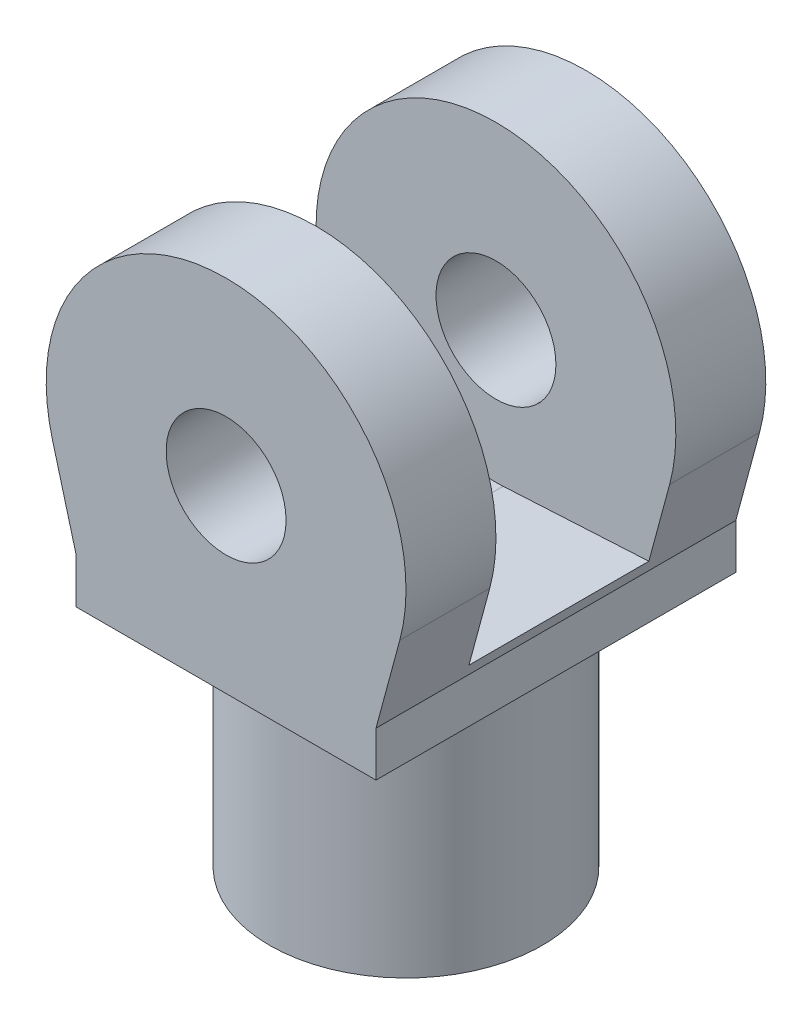
ISO-10303-21;
HEADER;
FILE_DESCRIPTION(('STEP AP214'),'2;1');
FILE_NAME('part.step','',(''),(''),'','','');
FILE_SCHEMA(('AUTOMOTIVE_DESIGN { 1 0 10303 214 1 1 1 1 }'));
ENDSEC;
DATA;
#1=APPLICATION_CONTEXT('core data for automotive mechanical design processes');
#2=APPLICATION_PROTOCOL_DEFINITION('international standard','automotive_design',2000,#1);
#3=PRODUCT_CONTEXT('',#1,'mechanical');
#4=PRODUCT('Part','Part','',(#3));
#5=PRODUCT_RELATED_PRODUCT_CATEGORY('part','',(#4));
#6=PRODUCT_DEFINITION_FORMATION('','',#4);
#7=PRODUCT_DEFINITION_CONTEXT('part definition',#1,'design');
#8=PRODUCT_DEFINITION('design','',#6,#7);
#9=PRODUCT_DEFINITION_SHAPE('','',#8);
#10=(LENGTH_UNIT() NAMED_UNIT(*) SI_UNIT(.MILLI.,.METRE.));
#11=(NAMED_UNIT(*) PLANE_ANGLE_UNIT() SI_UNIT($,.RADIAN.));
#12=(NAMED_UNIT(*) SI_UNIT($,.STERADIAN.) SOLID_ANGLE_UNIT());
#13=UNCERTAINTY_MEASURE_WITH_UNIT(LENGTH_MEASURE(1.E-05),#10,'distance_accuracy_value','');
#14=(GEOMETRIC_REPRESENTATION_CONTEXT(3) GLOBAL_UNCERTAINTY_ASSIGNED_CONTEXT((#13)) GLOBAL_UNIT_ASSIGNED_CONTEXT((#10,
#11,#12)) REPRESENTATION_CONTEXT('',''));
#15=CARTESIAN_POINT('',(0.,0.,0.));
#16=DIRECTION('',(0.,0.,1.));
#17=DIRECTION('',(1.,0.,0.));
#18=AXIS2_PLACEMENT_3D('',#15,#16,#17);
#19=CARTESIAN_POINT('',(0.,7.,3.));
#20=DIRECTION('',(0.,0.,-1.));
#21=DIRECTION('',(-1.,0.,0.));
#22=AXIS2_PLACEMENT_3D('',#19,#20,#21);
#23=CYLINDRICAL_SURFACE('',#22,3.);
#24=CARTESIAN_POINT('',(0.,7.,-1.5));
#25=DIRECTION('',(0.,0.,1.));
#26=DIRECTION('',(1.,0.,0.));
#27=AXIS2_PLACEMENT_3D('',#24,#25,#26);
#28=CIRCLE('',#27,3.);
#29=CARTESIAN_POINT('',(2.89632369236493,6.21813743596103,-1.5));
#30=VERTEX_POINT('',#29);
#31=CARTESIAN_POINT('',(-2.89632369236493,6.21813743596103,-1.5));
#32=VERTEX_POINT('',#31);
#33=EDGE_CURVE('E178',#30,#32,#28,.T.);
#34=ORIENTED_EDGE('',*,*,#33,.F.);
#35=DIRECTION('',(0.,0.,-1.));
#36=VECTOR('',#35,1.);
#37=CARTESIAN_POINT('',(2.89632369236493,6.21813743596103,3.));
#38=LINE('',#37,#36);
#39=CARTESIAN_POINT('',(2.89632369236493,6.21813743596103,-3.));
#40=VERTEX_POINT('',#39);
#41=EDGE_CURVE('E197',#30,#40,#38,.T.);
#42=ORIENTED_EDGE('',*,*,#41,.T.);
#43=CARTESIAN_POINT('',(0.,7.,-3.));
#44=DIRECTION('',(0.,0.,1.));
#45=DIRECTION('',(-1.,0.,0.));
#46=AXIS2_PLACEMENT_3D('',#43,#44,#45);
#47=CIRCLE('',#46,3.);
#48=CARTESIAN_POINT('',(-2.89632369236493,6.21813743596103,-3.));
#49=VERTEX_POINT('',#48);
#50=EDGE_CURVE('E186',#40,#49,#47,.T.);
#51=ORIENTED_EDGE('',*,*,#50,.T.);
#52=DIRECTION('',(0.,0.,-1.));
#53=VECTOR('',#52,1.);
#54=CARTESIAN_POINT('',(-2.89632369236493,6.21813743596103,3.));
#55=LINE('',#54,#53);
#56=EDGE_CURVE('E208',#32,#49,#55,.T.);
#57=ORIENTED_EDGE('',*,*,#56,.F.);
#58=EDGE_LOOP('',(#34,#42,#51,#57));
#59=FACE_BOUND('',#58,.T.);
#60=ADVANCED_FACE('F35',(#59),#23,.T.);
#61=CARTESIAN_POINT('',(-2.89632369236493,6.21813743596103,3.));
#62=DIRECTION('',(0.965441230788309,0.260620854679657,0.));
#63=DIRECTION('',(-0.260620854679657,0.965441230788309,0.));
#64=AXIS2_PLACEMENT_3D('',#61,#62,#63);
#65=PLANE('',#64);
#66=DIRECTION('',(0.260620854679657,-0.965441230788309,0.));
#67=VECTOR('',#66,1.);
#68=CARTESIAN_POINT('',(-2.89632369236493,6.21813743596103,-1.5));
#69=LINE('',#68,#67);
#70=CARTESIAN_POINT('',(-2.55011584364664,4.93564861907034,-1.5));
#71=VERTEX_POINT('',#70);
#72=EDGE_CURVE('E180',#32,#71,#69,.T.);
#73=ORIENTED_EDGE('',*,*,#72,.F.);
#74=ORIENTED_EDGE('',*,*,#56,.T.);
#75=DIRECTION('',(0.260620854679657,-0.965441230788309,0.));
#76=VECTOR('',#75,1.);
#77=CARTESIAN_POINT('',(-2.89632369236493,6.21813743596103,-3.));
#78=LINE('',#77,#76);
#79=CARTESIAN_POINT('',(-2.5,4.75,-3.));
#80=VERTEX_POINT('',#79);
#81=EDGE_CURVE('E200',#49,#80,#78,.T.);
#82=ORIENTED_EDGE('',*,*,#81,.T.);
#83=DIRECTION('',(0.,0.,1.));
#84=VECTOR('',#83,1.);
#85=CARTESIAN_POINT('',(-2.5,4.75,3.));
#86=LINE('',#85,#84);
#87=CARTESIAN_POINT('',(-2.5,4.75,3.));
#88=VERTEX_POINT('',#87);
#89=EDGE_CURVE('E215',#80,#88,#86,.T.);
#90=ORIENTED_EDGE('',*,*,#89,.T.);
#91=DIRECTION('',(0.260620854679657,-0.965441230788309,0.));
#92=VECTOR('',#91,1.);
#93=CARTESIAN_POINT('',(-2.89632369236493,6.21813743596103,3.));
#94=LINE('',#93,#92);
#95=CARTESIAN_POINT('',(-2.89632369236493,6.21813743596103,3.));
#96=VERTEX_POINT('',#95);
#97=EDGE_CURVE('E192',#96,#88,#94,.T.);
#98=ORIENTED_EDGE('',*,*,#97,.F.);
#99=CARTESIAN_POINT('',(-2.89632369236493,6.21813743596103,1.5));
#100=VERTEX_POINT('',#99);
#101=EDGE_CURVE('E209',#96,#100,#55,.T.);
#102=ORIENTED_EDGE('',*,*,#101,.T.);
#103=DIRECTION('',(0.260620854679657,-0.965441230788309,0.));
#104=VECTOR('',#103,1.);
#105=CARTESIAN_POINT('',(-2.89632369236493,6.21813743596103,1.5));
#106=LINE('',#105,#104);
#107=CARTESIAN_POINT('',(-2.55011584364664,4.93564861907034,1.5));
#108=VERTEX_POINT('',#107);
#109=EDGE_CURVE('E172',#100,#108,#106,.T.);
#110=ORIENTED_EDGE('',*,*,#109,.T.);
#111=DIRECTION('',(0.,0.,-1.));
#112=VECTOR('',#111,1.);
#113=CARTESIAN_POINT('',(-2.55011584364664,4.93564861907034,3.));
#114=LINE('',#113,#112);
#115=EDGE_CURVE('E11',#108,#71,#114,.T.);
#116=ORIENTED_EDGE('',*,*,#115,.T.);
#117=EDGE_LOOP('',(#73,#74,#82,#90,#98,#102,#110,#116));
#118=FACE_BOUND('',#117,.T.);
#119=ADVANCED_FACE('F251',(#118),#65,.F.);
#120=CARTESIAN_POINT('',(2.5,4.75,3.));
#121=DIRECTION('',(-0.965441230788309,0.260620854679657,0.));
#122=DIRECTION('',(-0.260620854679657,-0.965441230788309,0.));
#123=AXIS2_PLACEMENT_3D('',#120,#121,#122);
#124=PLANE('',#123);
#125=DIRECTION('',(0.260620854679657,0.965441230788309,0.));
#126=VECTOR('',#125,1.);
#127=CARTESIAN_POINT('',(2.5,4.75,-1.5));
#128=LINE('',#127,#126);
#129=CARTESIAN_POINT('',(2.55011584364665,4.93564861907034,-1.5));
#130=VERTEX_POINT('',#129);
#131=EDGE_CURVE('E176',#130,#30,#128,.T.);
#132=ORIENTED_EDGE('',*,*,#131,.F.);
#133=DIRECTION('',(0.,0.,1.));
#134=VECTOR('',#133,1.);
#135=CARTESIAN_POINT('',(2.55011584364664,4.93564861907034,3.));
#136=LINE('',#135,#134);
#137=CARTESIAN_POINT('',(2.55011584364665,4.93564861907034,1.5));
#138=VERTEX_POINT('',#137);
#139=EDGE_CURVE('E43',#130,#138,#136,.T.);
#140=ORIENTED_EDGE('',*,*,#139,.T.);
#141=DIRECTION('',(0.260620854679657,0.965441230788309,0.));
#142=VECTOR('',#141,1.);
#143=CARTESIAN_POINT('',(2.5,4.75,1.5));
#144=LINE('',#143,#142);
#145=CARTESIAN_POINT('',(2.89632369236493,6.21813743596103,1.5));
#146=VERTEX_POINT('',#145);
#147=EDGE_CURVE('E169',#138,#146,#144,.T.);
#148=ORIENTED_EDGE('',*,*,#147,.T.);
#149=CARTESIAN_POINT('',(2.89632369236493,6.21813743596103,3.));
#150=VERTEX_POINT('',#149);
#151=EDGE_CURVE('E205',#150,#146,#38,.T.);
#152=ORIENTED_EDGE('',*,*,#151,.F.);
#153=DIRECTION('',(0.260620854679657,0.965441230788309,0.));
#154=VECTOR('',#153,1.);
#155=CARTESIAN_POINT('',(2.5,4.75,3.));
#156=LINE('',#155,#154);
#157=CARTESIAN_POINT('',(2.5,4.75,3.));
#158=VERTEX_POINT('',#157);
#159=EDGE_CURVE('E195',#158,#150,#156,.T.);
#160=ORIENTED_EDGE('',*,*,#159,.F.);
#161=DIRECTION('',(0.,0.,-1.));
#162=VECTOR('',#161,1.);
#163=CARTESIAN_POINT('',(2.5,4.75,3.));
#164=LINE('',#163,#162);
#165=CARTESIAN_POINT('',(2.5,4.75,-3.));
#166=VERTEX_POINT('',#165);
#167=EDGE_CURVE('E213',#158,#166,#164,.T.);
#168=ORIENTED_EDGE('',*,*,#167,.T.);
#169=DIRECTION('',(0.260620854679657,0.965441230788309,0.));
#170=VECTOR('',#169,1.);
#171=CARTESIAN_POINT('',(2.5,4.75,-3.));
#172=LINE('',#171,#170);
#173=EDGE_CURVE('E193',#166,#40,#172,.T.);
#174=ORIENTED_EDGE('',*,*,#173,.T.);
#175=ORIENTED_EDGE('',*,*,#41,.F.);
#176=EDGE_LOOP('',(#132,#140,#148,#152,#160,#168,#174,#175));
#177=FACE_BOUND('',#176,.T.);
#178=ADVANCED_FACE('F241',(#177),#124,.F.);
#179=CARTESIAN_POINT('',(0.,7.,3.));
#180=DIRECTION('',(0.,0.,-1.));
#181=DIRECTION('',(-1.,0.,0.));
#182=AXIS2_PLACEMENT_3D('',#179,#180,#181);
#183=CYLINDRICAL_SURFACE('',#182,1.);
#184=CARTESIAN_POINT('',(0.,7.,-3.));
#185=DIRECTION('',(0.,0.,1.));
#186=DIRECTION('',(1.,0.,0.));
#187=AXIS2_PLACEMENT_3D('',#184,#185,#186);
#188=CIRCLE('',#187,1.);
#189=CARTESIAN_POINT('',(1.,7.,-3.));
#190=VERTEX_POINT('',#189);
#191=EDGE_CURVE('E182',#190,#190,#188,.T.);
#192=ORIENTED_EDGE('',*,*,#191,.F.);
#193=EDGE_LOOP('',(#192));
#194=FACE_BOUND('',#193,.T.);
#195=CARTESIAN_POINT('',(0.,7.,-1.5));
#196=DIRECTION('',(0.,0.,1.));
#197=DIRECTION('',(1.,0.,0.));
#198=AXIS2_PLACEMENT_3D('',#195,#196,#197);
#199=CIRCLE('',#198,1.);
#200=CARTESIAN_POINT('',(1.,7.,-1.5));
#201=VERTEX_POINT('',#200);
#202=EDGE_CURVE('E175',#201,#201,#199,.T.);
#203=ORIENTED_EDGE('',*,*,#202,.T.);
#204=EDGE_LOOP('',(#203));
#205=FACE_BOUND('',#204,.T.);
#206=ADVANCED_FACE('F277',(#194,#205),#183,.F.);
#207=CARTESIAN_POINT('',(0.,4.,0.));
#208=DIRECTION('',(0.,-1.,0.));
#209=DIRECTION('',(0.,0.,-1.));
#210=AXIS2_PLACEMENT_3D('',#207,#208,#209);
#211=CYLINDRICAL_SURFACE('',#210,2.275);
#212=CARTESIAN_POINT('',(0.,4.,0.));
#213=DIRECTION('',(0.,1.,0.));
#214=DIRECTION('',(0.,0.,1.));
#215=AXIS2_PLACEMENT_3D('',#212,#213,#214);
#216=CIRCLE('',#215,2.275);
#217=CARTESIAN_POINT('',(0.,4.,2.275));
#218=VERTEX_POINT('',#217);
#219=EDGE_CURVE('E232',#218,#218,#216,.T.);
#220=ORIENTED_EDGE('',*,*,#219,.F.);
#221=EDGE_LOOP('',(#220));
#222=FACE_BOUND('',#221,.T.);
#223=CARTESIAN_POINT('',(0.,0.,0.));
#224=DIRECTION('',(0.,1.,0.));
#225=DIRECTION('',(0.,0.,1.));
#226=AXIS2_PLACEMENT_3D('',#223,#224,#225);
#227=CIRCLE('',#226,2.275);
#228=CARTESIAN_POINT('',(0.,0.,2.275));
#229=VERTEX_POINT('',#228);
#230=EDGE_CURVE('E231',#229,#229,#227,.T.);
#231=ORIENTED_EDGE('',*,*,#230,.T.);
#232=EDGE_LOOP('',(#231));
#233=FACE_BOUND('',#232,.T.);
#234=ADVANCED_FACE('F37',(#222,#233),#211,.T.);
#235=CARTESIAN_POINT('',(0.,0.,0.));
#236=DIRECTION('',(0.,1.,0.));
#237=DIRECTION('',(0.,0.,1.));
#238=AXIS2_PLACEMENT_3D('',#235,#236,#237);
#239=PLANE('',#238);
#240=ORIENTED_EDGE('',*,*,#230,.F.);
#241=EDGE_LOOP('',(#240));
#242=FACE_BOUND('',#241,.T.);
#243=ADVANCED_FACE('F271',(#242),#239,.F.);
#244=CARTESIAN_POINT('',(0.,4.,0.));
#245=DIRECTION('',(0.,-1.,0.));
#246=DIRECTION('',(0.,0.,-1.));
#247=AXIS2_PLACEMENT_3D('',#244,#245,#246);
#248=PLANE('',#247);
#249=DIRECTION('',(0.,0.,-1.));
#250=VECTOR('',#249,1.);
#251=CARTESIAN_POINT('',(2.5,4.,3.));
#252=LINE('',#251,#250);
#253=CARTESIAN_POINT('',(2.5,4.,3.));
#254=VERTEX_POINT('',#253);
#255=CARTESIAN_POINT('',(2.5,4.,-3.));
#256=VERTEX_POINT('',#255);
#257=EDGE_CURVE('E212',#254,#256,#252,.T.);
#258=ORIENTED_EDGE('',*,*,#257,.F.);
#259=DIRECTION('',(1.,0.,0.));
#260=VECTOR('',#259,1.);
#261=CARTESIAN_POINT('',(-2.5,4.,3.));
#262=LINE('',#261,#260);
#263=CARTESIAN_POINT('',(-2.5,4.,3.));
#264=VERTEX_POINT('',#263);
#265=EDGE_CURVE('E79',#264,#254,#262,.T.);
#266=ORIENTED_EDGE('',*,*,#265,.F.);
#267=DIRECTION('',(0.,0.,1.));
#268=VECTOR('',#267,1.);
#269=CARTESIAN_POINT('',(-2.5,4.,3.));
#270=LINE('',#269,#268);
#271=CARTESIAN_POINT('',(-2.5,4.,-3.));
#272=VERTEX_POINT('',#271);
#273=EDGE_CURVE('E222',#272,#264,#270,.T.);
#274=ORIENTED_EDGE('',*,*,#273,.F.);
#275=DIRECTION('',(-1.,0.,0.));
#276=VECTOR('',#275,1.);
#277=CARTESIAN_POINT('',(-2.5,4.,-3.));
#278=LINE('',#277,#276);
#279=EDGE_CURVE('E220',#256,#272,#278,.T.);
#280=ORIENTED_EDGE('',*,*,#279,.F.);
#281=EDGE_LOOP('',(#258,#266,#274,#280));
#282=FACE_BOUND('',#281,.T.);
#283=ORIENTED_EDGE('',*,*,#219,.T.);
#284=EDGE_LOOP('',(#283));
#285=FACE_BOUND('',#284,.T.);
#286=ADVANCED_FACE('F268',(#282,#285),#248,.T.);
#287=CARTESIAN_POINT('',(2.5,4.75,3.));
#288=DIRECTION('',(-1.,0.,0.));
#289=DIRECTION('',(0.,0.,1.));
#290=AXIS2_PLACEMENT_3D('',#287,#288,#289);
#291=PLANE('',#290);
#292=ORIENTED_EDGE('',*,*,#257,.T.);
#293=DIRECTION('',(0.,-1.,0.));
#294=VECTOR('',#293,1.);
#295=CARTESIAN_POINT('',(2.5,4.75,-3.));
#296=LINE('',#295,#294);
#297=EDGE_CURVE('E86',#166,#256,#296,.T.);
#298=ORIENTED_EDGE('',*,*,#297,.F.);
#299=ORIENTED_EDGE('',*,*,#167,.F.);
#300=DIRECTION('',(0.,-1.,0.));
#301=VECTOR('',#300,1.);
#302=CARTESIAN_POINT('',(2.5,4.75,3.));
#303=LINE('',#302,#301);
#304=EDGE_CURVE('E218',#158,#254,#303,.T.);
#305=ORIENTED_EDGE('',*,*,#304,.T.);
#306=EDGE_LOOP('',(#292,#298,#299,#305));
#307=FACE_BOUND('',#306,.T.);
#308=ADVANCED_FACE('F266',(#307),#291,.F.);
#309=CARTESIAN_POINT('',(-2.5,4.75,-3.));
#310=DIRECTION('',(0.,0.,1.));
#311=DIRECTION('',(1.,0.,0.));
#312=AXIS2_PLACEMENT_3D('',#309,#310,#311);
#313=PLANE('',#312);
#314=ORIENTED_EDGE('',*,*,#279,.T.);
#315=DIRECTION('',(0.,-1.,0.));
#316=VECTOR('',#315,1.);
#317=CARTESIAN_POINT('',(-2.5,4.75,-3.));
#318=LINE('',#317,#316);
#319=EDGE_CURVE('E227',#80,#272,#318,.T.);
#320=ORIENTED_EDGE('',*,*,#319,.F.);
#321=ORIENTED_EDGE('',*,*,#81,.F.);
#322=ORIENTED_EDGE('',*,*,#50,.F.);
#323=ORIENTED_EDGE('',*,*,#173,.F.);
#324=ORIENTED_EDGE('',*,*,#297,.T.);
#325=EDGE_LOOP('',(#314,#320,#321,#322,#323,#324));
#326=FACE_BOUND('',#325,.T.);
#327=ORIENTED_EDGE('',*,*,#191,.T.);
#328=EDGE_LOOP('',(#327));
#329=FACE_BOUND('',#328,.T.);
#330=ADVANCED_FACE('F253',(#326,#329),#313,.F.);
#331=CARTESIAN_POINT('',(-2.5,4.75,3.));
#332=DIRECTION('',(1.,0.,0.));
#333=DIRECTION('',(0.,0.,-1.));
#334=AXIS2_PLACEMENT_3D('',#331,#332,#333);
#335=PLANE('',#334);
#336=ORIENTED_EDGE('',*,*,#273,.T.);
#337=DIRECTION('',(0.,-1.,0.));
#338=VECTOR('',#337,1.);
#339=CARTESIAN_POINT('',(-2.5,4.75,3.));
#340=LINE('',#339,#338);
#341=EDGE_CURVE('E59',#88,#264,#340,.T.);
#342=ORIENTED_EDGE('',*,*,#341,.F.);
#343=ORIENTED_EDGE('',*,*,#89,.F.);
#344=ORIENTED_EDGE('',*,*,#319,.T.);
#345=EDGE_LOOP('',(#336,#342,#343,#344));
#346=FACE_BOUND('',#345,.T.);
#347=ADVANCED_FACE('F257',(#346),#335,.F.);
#348=CARTESIAN_POINT('',(-2.5,4.75,3.));
#349=DIRECTION('',(0.,0.,-1.));
#350=DIRECTION('',(-1.,0.,0.));
#351=AXIS2_PLACEMENT_3D('',#348,#349,#350);
#352=PLANE('',#351);
#353=ORIENTED_EDGE('',*,*,#265,.T.);
#354=ORIENTED_EDGE('',*,*,#304,.F.);
#355=ORIENTED_EDGE('',*,*,#159,.T.);
#356=CARTESIAN_POINT('',(0.,7.,3.));
#357=DIRECTION('',(0.,0.,1.));
#358=DIRECTION('',(-1.,0.,0.));
#359=AXIS2_PLACEMENT_3D('',#356,#357,#358);
#360=CIRCLE('',#359,3.);
#361=EDGE_CURVE('E189',#150,#96,#360,.T.);
#362=ORIENTED_EDGE('',*,*,#361,.T.);
#363=ORIENTED_EDGE('',*,*,#97,.T.);
#364=ORIENTED_EDGE('',*,*,#341,.T.);
#365=EDGE_LOOP('',(#353,#354,#355,#362,#363,#364));
#366=FACE_BOUND('',#365,.T.);
#367=CARTESIAN_POINT('',(0.,7.,3.));
#368=DIRECTION('',(0.,0.,1.));
#369=DIRECTION('',(1.,0.,0.));
#370=AXIS2_PLACEMENT_3D('',#367,#368,#369);
#371=CIRCLE('',#370,1.);
#372=CARTESIAN_POINT('',(1.,7.,3.));
#373=VERTEX_POINT('',#372);
#374=EDGE_CURVE('E183',#373,#373,#371,.T.);
#375=ORIENTED_EDGE('',*,*,#374,.F.);
#376=EDGE_LOOP('',(#375));
#377=FACE_BOUND('',#376,.T.);
#378=ADVANCED_FACE('F260',(#366,#377),#352,.F.);
#379=ORIENTED_EDGE('',*,*,#151,.T.);
#380=CARTESIAN_POINT('',(0.,7.,1.5));
#381=DIRECTION('',(0.,0.,1.));
#382=DIRECTION('',(1.,0.,0.));
#383=AXIS2_PLACEMENT_3D('',#380,#381,#382);
#384=CIRCLE('',#383,3.);
#385=EDGE_CURVE('E50',#146,#100,#384,.T.);
#386=ORIENTED_EDGE('',*,*,#385,.T.);
#387=ORIENTED_EDGE('',*,*,#101,.F.);
#388=ORIENTED_EDGE('',*,*,#361,.F.);
#389=EDGE_LOOP('',(#379,#386,#387,#388));
#390=FACE_BOUND('',#389,.T.);
#391=ADVANCED_FACE('F264',(#390),#23,.T.);
#392=CARTESIAN_POINT('',(0.,7.,1.5));
#393=DIRECTION('',(0.,0.,1.));
#394=DIRECTION('',(1.,0.,0.));
#395=AXIS2_PLACEMENT_3D('',#392,#393,#394);
#396=CIRCLE('',#395,1.);
#397=CARTESIAN_POINT('',(1.,7.,1.5));
#398=VERTEX_POINT('',#397);
#399=EDGE_CURVE('E167',#398,#398,#396,.T.);
#400=ORIENTED_EDGE('',*,*,#399,.F.);
#401=EDGE_LOOP('',(#400));
#402=FACE_BOUND('',#401,.T.);
#403=ORIENTED_EDGE('',*,*,#374,.T.);
#404=EDGE_LOOP('',(#403));
#405=FACE_BOUND('',#404,.T.);
#406=ADVANCED_FACE('F291',(#402,#405),#183,.F.);
#407=CARTESIAN_POINT('',(-0.119661191668474,4.80325668335864,-1.5));
#408=DIRECTION('',(-0.0543914507583975,-0.998519689382436,0.));
#409=DIRECTION('',(0.998519689382436,-0.0543914507583975,0.));
#410=AXIS2_PLACEMENT_3D('',#407,#408,#409);
#411=PLANE('',#410);
#412=DIRECTION('',(0.998519689382436,-0.0543914507583975,0.));
#413=VECTOR('',#412,1.);
#414=CARTESIAN_POINT('',(-0.119661191668474,4.80325668335864,1.5));
#415=LINE('',#414,#413);
#416=CARTESIAN_POINT('',(-0.119661191668474,4.80325668335864,1.5));
#417=VERTEX_POINT('',#416);
#418=EDGE_CURVE('E159',#108,#417,#415,.T.);
#419=ORIENTED_EDGE('',*,*,#418,.T.);
#420=DIRECTION('',(0.,0.,1.));
#421=VECTOR('',#420,1.);
#422=CARTESIAN_POINT('',(-0.119661191668474,4.80325668335864,-1.5));
#423=LINE('',#422,#421);
#424=CARTESIAN_POINT('',(-0.119661191668474,4.80325668335864,-1.5));
#425=VERTEX_POINT('',#424);
#426=EDGE_CURVE('E146',#425,#417,#423,.T.);
#427=ORIENTED_EDGE('',*,*,#426,.F.);
#428=DIRECTION('',(0.998519689382436,-0.0543914507583975,0.));
#429=VECTOR('',#428,1.);
#430=CARTESIAN_POINT('',(-0.119661191668474,4.80325668335864,-1.5));
#431=LINE('',#430,#429);
#432=EDGE_CURVE('E147',#71,#425,#431,.T.);
#433=ORIENTED_EDGE('',*,*,#432,.F.);
#434=ORIENTED_EDGE('',*,*,#115,.F.);
#435=EDGE_LOOP('',(#419,#427,#433,#434));
#436=FACE_BOUND('',#435,.T.);
#437=ADVANCED_FACE('F296',(#436),#411,.F.);
#438=CARTESIAN_POINT('',(17.5,5.75,-1.5));
#439=DIRECTION('',(0.0543914507583975,-0.998519689382436,0.));
#440=DIRECTION('',(0.998519689382436,0.0543914507583975,0.));
#441=AXIS2_PLACEMENT_3D('',#438,#439,#440);
#442=PLANE('',#441);
#443=DIRECTION('',(0.998519689382436,0.0543914507583975,0.));
#444=VECTOR('',#443,1.);
#445=CARTESIAN_POINT('',(17.5,5.75,-1.5));
#446=LINE('',#445,#444);
#447=CARTESIAN_POINT('',(0.119661191668474,4.80325668335864,-1.5));
#448=VERTEX_POINT('',#447);
#449=EDGE_CURVE('E150',#448,#130,#446,.T.);
#450=ORIENTED_EDGE('',*,*,#449,.F.);
#451=DIRECTION('',(0.,0.,1.));
#452=VECTOR('',#451,1.);
#453=CARTESIAN_POINT('',(0.119661191668474,4.80325668335864,-1.5));
#454=LINE('',#453,#452);
#455=CARTESIAN_POINT('',(0.119661191668474,4.80325668335864,1.5));
#456=VERTEX_POINT('',#455);
#457=EDGE_CURVE('E135',#448,#456,#454,.T.);
#458=ORIENTED_EDGE('',*,*,#457,.T.);
#459=DIRECTION('',(0.998519689382436,0.0543914507583975,0.));
#460=VECTOR('',#459,1.);
#461=CARTESIAN_POINT('',(17.5,5.75,1.5));
#462=LINE('',#461,#460);
#463=EDGE_CURVE('E161',#456,#138,#462,.T.);
#464=ORIENTED_EDGE('',*,*,#463,.T.);
#465=ORIENTED_EDGE('',*,*,#139,.F.);
#466=EDGE_LOOP('',(#450,#458,#464,#465));
#467=FACE_BOUND('',#466,.T.);
#468=ADVANCED_FACE('F151',(#467),#442,.F.);
#469=CARTESIAN_POINT('',(0.,7.,-1.5));
#470=DIRECTION('',(0.,0.,1.));
#471=DIRECTION('',(1.,0.,0.));
#472=AXIS2_PLACEMENT_3D('',#469,#470,#471);
#473=PLANE('',#472);
#474=ORIENTED_EDGE('',*,*,#202,.F.);
#475=EDGE_LOOP('',(#474));
#476=FACE_BOUND('',#475,.T.);
#477=ORIENTED_EDGE('',*,*,#72,.T.);
#478=ORIENTED_EDGE('',*,*,#432,.T.);
#479=CARTESIAN_POINT('',(0.,7.,-1.5));
#480=DIRECTION('',(0.,0.,1.));
#481=DIRECTION('',(1.,0.,0.));
#482=AXIS2_PLACEMENT_3D('',#479,#480,#481);
#483=CIRCLE('',#482,2.2);
#484=EDGE_CURVE('E140',#425,#448,#483,.T.);
#485=ORIENTED_EDGE('',*,*,#484,.T.);
#486=ORIENTED_EDGE('',*,*,#449,.T.);
#487=ORIENTED_EDGE('',*,*,#131,.T.);
#488=ORIENTED_EDGE('',*,*,#33,.T.);
#489=EDGE_LOOP('',(#477,#478,#485,#486,#487,#488));
#490=FACE_BOUND('',#489,.T.);
#491=ADVANCED_FACE('F156',(#476,#490),#473,.T.);
#492=CARTESIAN_POINT('',(0.,7.,1.5));
#493=DIRECTION('',(0.,0.,1.));
#494=DIRECTION('',(1.,0.,0.));
#495=AXIS2_PLACEMENT_3D('',#492,#493,#494);
#496=PLANE('',#495);
#497=ORIENTED_EDGE('',*,*,#399,.T.);
#498=EDGE_LOOP('',(#497));
#499=FACE_BOUND('',#498,.T.);
#500=ORIENTED_EDGE('',*,*,#385,.F.);
#501=ORIENTED_EDGE('',*,*,#147,.F.);
#502=ORIENTED_EDGE('',*,*,#463,.F.);
#503=CARTESIAN_POINT('',(0.,7.,1.5));
#504=DIRECTION('',(0.,0.,1.));
#505=DIRECTION('',(1.,0.,0.));
#506=AXIS2_PLACEMENT_3D('',#503,#504,#505);
#507=CIRCLE('',#506,2.2);
#508=EDGE_CURVE('E142',#417,#456,#507,.T.);
#509=ORIENTED_EDGE('',*,*,#508,.F.);
#510=ORIENTED_EDGE('',*,*,#418,.F.);
#511=ORIENTED_EDGE('',*,*,#109,.F.);
#512=EDGE_LOOP('',(#500,#501,#502,#509,#510,#511));
#513=FACE_BOUND('',#512,.T.);
#514=ADVANCED_FACE('F387',(#499,#513),#496,.F.);
#515=CARTESIAN_POINT('',(0.,7.,-1.5));
#516=DIRECTION('',(0.,0.,1.));
#517=DIRECTION('',(1.,0.,0.));
#518=AXIS2_PLACEMENT_3D('',#515,#516,#517);
#519=CYLINDRICAL_SURFACE('',#518,2.2);
#520=ORIENTED_EDGE('',*,*,#508,.T.);
#521=ORIENTED_EDGE('',*,*,#457,.F.);
#522=ORIENTED_EDGE('',*,*,#484,.F.);
#523=ORIENTED_EDGE('',*,*,#426,.T.);
#524=EDGE_LOOP('',(#520,#521,#522,#523));
#525=FACE_BOUND('',#524,.T.);
#526=ADVANCED_FACE('F137',(#525),#519,.F.);
#527=CLOSED_SHELL('',(#60,#119,#178,#206,#234,#243,#286,#308,#330,#347,#378,#391,#406,#437,#468,
#491,#514,#526));
#528=MANIFOLD_SOLID_BREP('B2',#527);
#529=ADVANCED_BREP_SHAPE_REPRESENTATION('',(#18,#528),#14);
#530=SHAPE_DEFINITION_REPRESENTATION(#9,#529);
ENDSEC;
END-ISO-10303-21;
